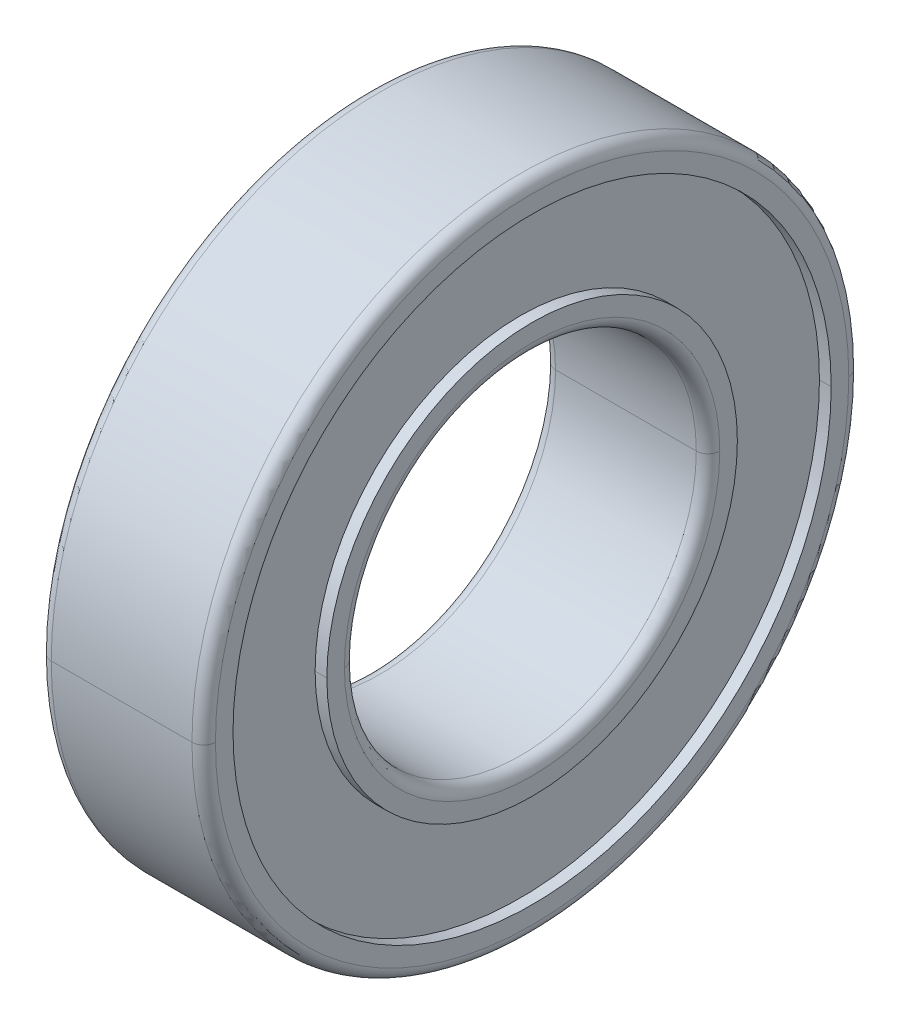
ISO-10303-21;
HEADER;
FILE_DESCRIPTION(('STEP AP214'),'2;1');
FILE_NAME('part.step','',(''),(''),'','','');
FILE_SCHEMA(('AUTOMOTIVE_DESIGN { 1 0 10303 214 1 1 1 1 }'));
ENDSEC;
DATA;
#1=APPLICATION_CONTEXT('core data for automotive mechanical design processes');
#2=APPLICATION_PROTOCOL_DEFINITION('international standard','automotive_design',2000,#1);
#3=PRODUCT_CONTEXT('',#1,'mechanical');
#4=PRODUCT('Part','Part','',(#3));
#5=PRODUCT_RELATED_PRODUCT_CATEGORY('part','',(#4));
#6=PRODUCT_DEFINITION_FORMATION('','',#4);
#7=PRODUCT_DEFINITION_CONTEXT('part definition',#1,'design');
#8=PRODUCT_DEFINITION('design','',#6,#7);
#9=PRODUCT_DEFINITION_SHAPE('','',#8);
#10=(LENGTH_UNIT() NAMED_UNIT(*) SI_UNIT(.MILLI.,.METRE.));
#11=(NAMED_UNIT(*) PLANE_ANGLE_UNIT() SI_UNIT($,.RADIAN.));
#12=(NAMED_UNIT(*) SI_UNIT($,.STERADIAN.) SOLID_ANGLE_UNIT());
#13=UNCERTAINTY_MEASURE_WITH_UNIT(LENGTH_MEASURE(1.E-05),#10,'distance_accuracy_value','');
#14=(GEOMETRIC_REPRESENTATION_CONTEXT(3) GLOBAL_UNCERTAINTY_ASSIGNED_CONTEXT((#13)) GLOBAL_UNIT_ASSIGNED_CONTEXT((#10,
#11,#12)) REPRESENTATION_CONTEXT('',''));
#15=CARTESIAN_POINT('',(0.,0.,0.));
#16=DIRECTION('',(0.,0.,1.));
#17=DIRECTION('',(1.,0.,0.));
#18=AXIS2_PLACEMENT_3D('',#15,#16,#17);
#19=CARTESIAN_POINT('',(0.5,0.,0.));
#20=DIRECTION('',(1.,0.,0.));
#21=DIRECTION('',(0.,0.,-1.));
#22=AXIS2_PLACEMENT_3D('',#19,#20,#21);
#23=TOROIDAL_SURFACE('',#22,13.5,0.5);
#24=CARTESIAN_POINT('',(0.5,0.,13.5));
#25=DIRECTION('',(0.,1.,0.));
#26=DIRECTION('',(0.,0.,1.));
#27=AXIS2_PLACEMENT_3D('',#24,#25,#26);
#28=CIRCLE('',#27,0.5);
#29=CARTESIAN_POINT('',(0.,0.,13.5));
#30=VERTEX_POINT('',#29);
#31=CARTESIAN_POINT('',(0.5,0.,14.));
#32=VERTEX_POINT('',#31);
#33=EDGE_CURVE('E245',#30,#32,#28,.T.);
#34=ORIENTED_EDGE('',*,*,#33,.F.);
#35=CARTESIAN_POINT('',(0.,0.,0.));
#36=DIRECTION('',(-1.,0.,0.));
#37=DIRECTION('',(0.,0.,-1.));
#38=AXIS2_PLACEMENT_3D('',#35,#36,#37);
#39=CIRCLE('',#38,13.5);
#40=CARTESIAN_POINT('',(0.,0.,-13.5));
#41=VERTEX_POINT('',#40);
#42=EDGE_CURVE('E190',#41,#30,#39,.T.);
#43=ORIENTED_EDGE('',*,*,#42,.F.);
#44=CARTESIAN_POINT('',(0.5,0.,-13.5));
#45=DIRECTION('',(0.,-1.,0.));
#46=DIRECTION('',(0.,0.,-1.));
#47=AXIS2_PLACEMENT_3D('',#44,#45,#46);
#48=CIRCLE('',#47,0.5);
#49=CARTESIAN_POINT('',(0.5,0.,-14.));
#50=VERTEX_POINT('',#49);
#51=EDGE_CURVE('E244',#41,#50,#48,.T.);
#52=ORIENTED_EDGE('',*,*,#51,.T.);
#53=CARTESIAN_POINT('',(0.5,0.,0.));
#54=DIRECTION('',(1.,0.,0.));
#55=DIRECTION('',(0.,0.,-1.));
#56=AXIS2_PLACEMENT_3D('',#53,#54,#55);
#57=CIRCLE('',#56,14.);
#58=EDGE_CURVE('E292',#32,#50,#57,.T.);
#59=ORIENTED_EDGE('',*,*,#58,.F.);
#60=EDGE_LOOP('',(#34,#43,#52,#59));
#61=FACE_BOUND('',#60,.T.);
#62=ADVANCED_FACE('F17',(#61),#23,.T.);
#63=CARTESIAN_POINT('',(6.5,0.,0.));
#64=DIRECTION('',(-1.,0.,0.));
#65=DIRECTION('',(0.,0.,1.));
#66=AXIS2_PLACEMENT_3D('',#63,#64,#65);
#67=TOROIDAL_SURFACE('',#66,13.5,0.5);
#68=CARTESIAN_POINT('',(6.5,0.,-13.5));
#69=DIRECTION('',(0.,1.,0.));
#70=DIRECTION('',(0.,0.,1.));
#71=AXIS2_PLACEMENT_3D('',#68,#69,#70);
#72=CIRCLE('',#71,0.5);
#73=CARTESIAN_POINT('',(7.,0.,-13.5));
#74=VERTEX_POINT('',#73);
#75=CARTESIAN_POINT('',(6.5,0.,-14.));
#76=VERTEX_POINT('',#75);
#77=EDGE_CURVE('E298',#74,#76,#72,.T.);
#78=ORIENTED_EDGE('',*,*,#77,.F.);
#79=CARTESIAN_POINT('',(7.,0.,0.));
#80=DIRECTION('',(1.,0.,0.));
#81=DIRECTION('',(0.,0.,1.));
#82=AXIS2_PLACEMENT_3D('',#79,#80,#81);
#83=CIRCLE('',#82,13.5);
#84=CARTESIAN_POINT('',(7.,0.,13.5));
#85=VERTEX_POINT('',#84);
#86=EDGE_CURVE('E223',#85,#74,#83,.T.);
#87=ORIENTED_EDGE('',*,*,#86,.F.);
#88=CARTESIAN_POINT('',(6.5,0.,13.5));
#89=DIRECTION('',(0.,-1.,0.));
#90=DIRECTION('',(0.,0.,-1.));
#91=AXIS2_PLACEMENT_3D('',#88,#89,#90);
#92=CIRCLE('',#91,0.5);
#93=CARTESIAN_POINT('',(6.5,0.,14.));
#94=VERTEX_POINT('',#93);
#95=EDGE_CURVE('E240',#85,#94,#92,.T.);
#96=ORIENTED_EDGE('',*,*,#95,.T.);
#97=CARTESIAN_POINT('',(6.5,0.,0.));
#98=DIRECTION('',(-1.,0.,0.));
#99=DIRECTION('',(0.,0.,1.));
#100=AXIS2_PLACEMENT_3D('',#97,#98,#99);
#101=CIRCLE('',#100,14.);
#102=EDGE_CURVE('E338',#76,#94,#101,.T.);
#103=ORIENTED_EDGE('',*,*,#102,.F.);
#104=EDGE_LOOP('',(#78,#87,#96,#103));
#105=FACE_BOUND('',#104,.T.);
#106=ADVANCED_FACE('F386',(#105),#67,.T.);
#107=CARTESIAN_POINT('',(0.5,0.,0.));
#108=DIRECTION('',(1.,0.,0.));
#109=DIRECTION('',(0.,0.,-1.));
#110=AXIS2_PLACEMENT_3D('',#107,#108,#109);
#111=TOROIDAL_SURFACE('',#110,8.,0.5);
#112=CARTESIAN_POINT('',(0.5,0.,8.));
#113=DIRECTION('',(0.,1.,0.));
#114=DIRECTION('',(0.,0.,1.));
#115=AXIS2_PLACEMENT_3D('',#112,#113,#114);
#116=CIRCLE('',#115,0.5);
#117=CARTESIAN_POINT('',(0.5,0.,7.5));
#118=VERTEX_POINT('',#117);
#119=CARTESIAN_POINT('',(0.,0.,8.));
#120=VERTEX_POINT('',#119);
#121=EDGE_CURVE('E239',#118,#120,#116,.T.);
#122=ORIENTED_EDGE('',*,*,#121,.F.);
#123=CARTESIAN_POINT('',(0.5,0.,0.));
#124=DIRECTION('',(-1.,0.,0.));
#125=DIRECTION('',(0.,0.,-1.));
#126=AXIS2_PLACEMENT_3D('',#123,#124,#125);
#127=CIRCLE('',#126,7.5);
#128=CARTESIAN_POINT('',(0.5,0.,-7.5));
#129=VERTEX_POINT('',#128);
#130=EDGE_CURVE('E283',#129,#118,#127,.T.);
#131=ORIENTED_EDGE('',*,*,#130,.F.);
#132=CARTESIAN_POINT('',(0.5,0.,-8.));
#133=DIRECTION('',(0.,-1.,0.));
#134=DIRECTION('',(0.,0.,-1.));
#135=AXIS2_PLACEMENT_3D('',#132,#133,#134);
#136=CIRCLE('',#135,0.5);
#137=CARTESIAN_POINT('',(0.,0.,-8.));
#138=VERTEX_POINT('',#137);
#139=EDGE_CURVE('E228',#129,#138,#136,.T.);
#140=ORIENTED_EDGE('',*,*,#139,.T.);
#141=CARTESIAN_POINT('',(0.,0.,0.));
#142=DIRECTION('',(1.,0.,0.));
#143=DIRECTION('',(0.,0.,-1.));
#144=AXIS2_PLACEMENT_3D('',#141,#142,#143);
#145=CIRCLE('',#144,8.);
#146=EDGE_CURVE('E261',#120,#138,#145,.T.);
#147=ORIENTED_EDGE('',*,*,#146,.F.);
#148=EDGE_LOOP('',(#122,#131,#140,#147));
#149=FACE_BOUND('',#148,.T.);
#150=ADVANCED_FACE('F408',(#149),#111,.T.);
#151=CARTESIAN_POINT('',(6.5,0.,0.));
#152=DIRECTION('',(-1.,0.,0.));
#153=DIRECTION('',(0.,0.,1.));
#154=AXIS2_PLACEMENT_3D('',#151,#152,#153);
#155=TOROIDAL_SURFACE('',#154,8.,0.5);
#156=CARTESIAN_POINT('',(6.5,0.,-8.));
#157=DIRECTION('',(0.,1.,0.));
#158=DIRECTION('',(0.,0.,1.));
#159=AXIS2_PLACEMENT_3D('',#156,#157,#158);
#160=CIRCLE('',#159,0.5);
#161=CARTESIAN_POINT('',(6.5,0.,-7.5));
#162=VERTEX_POINT('',#161);
#163=CARTESIAN_POINT('',(7.,0.,-8.));
#164=VERTEX_POINT('',#163);
#165=EDGE_CURVE('E227',#162,#164,#160,.T.);
#166=ORIENTED_EDGE('',*,*,#165,.F.);
#167=CARTESIAN_POINT('',(6.5,0.,0.));
#168=DIRECTION('',(1.,0.,0.));
#169=DIRECTION('',(0.,0.,1.));
#170=AXIS2_PLACEMENT_3D('',#167,#168,#169);
#171=CIRCLE('',#170,7.5);
#172=CARTESIAN_POINT('',(6.5,0.,7.5));
#173=VERTEX_POINT('',#172);
#174=EDGE_CURVE('E211',#173,#162,#171,.T.);
#175=ORIENTED_EDGE('',*,*,#174,.F.);
#176=CARTESIAN_POINT('',(6.5,0.,8.));
#177=DIRECTION('',(0.,-1.,0.));
#178=DIRECTION('',(0.,0.,-1.));
#179=AXIS2_PLACEMENT_3D('',#176,#177,#178);
#180=CIRCLE('',#179,0.5);
#181=CARTESIAN_POINT('',(7.,0.,8.));
#182=VERTEX_POINT('',#181);
#183=EDGE_CURVE('E277',#173,#182,#180,.T.);
#184=ORIENTED_EDGE('',*,*,#183,.T.);
#185=CARTESIAN_POINT('',(7.,0.,0.));
#186=DIRECTION('',(-1.,0.,0.));
#187=DIRECTION('',(0.,0.,1.));
#188=AXIS2_PLACEMENT_3D('',#185,#186,#187);
#189=CIRCLE('',#188,8.);
#190=EDGE_CURVE('E232',#164,#182,#189,.T.);
#191=ORIENTED_EDGE('',*,*,#190,.F.);
#192=EDGE_LOOP('',(#166,#175,#184,#191));
#193=FACE_BOUND('',#192,.T.);
#194=ADVANCED_FACE('F482',(#193),#155,.T.);
#195=CARTESIAN_POINT('',(0.,0.,0.));
#196=DIRECTION('',(-1.,0.,0.));
#197=DIRECTION('',(0.,0.,1.));
#198=AXIS2_PLACEMENT_3D('',#195,#196,#197);
#199=CYLINDRICAL_SURFACE('',#198,8.75);
#200=DIRECTION('',(-1.,0.,0.));
#201=VECTOR('',#200,1.);
#202=CARTESIAN_POINT('',(0.,0.,-8.75));
#203=LINE('',#202,#201);
#204=CARTESIAN_POINT('',(0.5,0.,-8.75));
#205=VERTEX_POINT('',#204);
#206=CARTESIAN_POINT('',(0.,0.,-8.75));
#207=VERTEX_POINT('',#206);
#208=EDGE_CURVE('E321',#205,#207,#203,.T.);
#209=ORIENTED_EDGE('',*,*,#208,.F.);
#210=CARTESIAN_POINT('',(0.5,0.,0.));
#211=DIRECTION('',(-1.,0.,0.));
#212=DIRECTION('',(0.,0.,1.));
#213=AXIS2_PLACEMENT_3D('',#210,#211,#212);
#214=CIRCLE('',#213,8.75);
#215=CARTESIAN_POINT('',(0.5,0.,8.75));
#216=VERTEX_POINT('',#215);
#217=EDGE_CURVE('E11',#205,#216,#214,.T.);
#218=ORIENTED_EDGE('',*,*,#217,.T.);
#219=DIRECTION('',(-1.,0.,0.));
#220=VECTOR('',#219,1.);
#221=CARTESIAN_POINT('',(0.,0.,8.75));
#222=LINE('',#221,#220);
#223=CARTESIAN_POINT('',(0.,0.,8.75));
#224=VERTEX_POINT('',#223);
#225=EDGE_CURVE('E207',#216,#224,#222,.T.);
#226=ORIENTED_EDGE('',*,*,#225,.T.);
#227=CARTESIAN_POINT('',(0.,0.,0.));
#228=DIRECTION('',(-1.,0.,0.));
#229=DIRECTION('',(0.,0.,1.));
#230=AXIS2_PLACEMENT_3D('',#227,#228,#229);
#231=CIRCLE('',#230,8.75);
#232=EDGE_CURVE('E333',#207,#224,#231,.T.);
#233=ORIENTED_EDGE('',*,*,#232,.F.);
#234=EDGE_LOOP('',(#209,#218,#226,#233));
#235=FACE_BOUND('',#234,.T.);
#236=ADVANCED_FACE('F412',(#235),#199,.T.);
#237=CARTESIAN_POINT('',(0.5,12.75,0.));
#238=DIRECTION('',(1.,0.,0.));
#239=DIRECTION('',(0.,1.,0.));
#240=AXIS2_PLACEMENT_3D('',#237,#238,#239);
#241=PLANE('',#240);
#242=CARTESIAN_POINT('',(0.5,0.,0.));
#243=DIRECTION('',(-1.,0.,0.));
#244=DIRECTION('',(0.,0.,1.));
#245=AXIS2_PLACEMENT_3D('',#242,#243,#244);
#246=CIRCLE('',#245,8.75);
#247=EDGE_CURVE('E280',#216,#205,#246,.T.);
#248=ORIENTED_EDGE('',*,*,#247,.F.);
#249=ORIENTED_EDGE('',*,*,#217,.F.);
#250=EDGE_LOOP('',(#248,#249));
#251=FACE_BOUND('',#250,.T.);
#252=CARTESIAN_POINT('',(0.5,0.,0.));
#253=DIRECTION('',(-1.,0.,0.));
#254=DIRECTION('',(0.,0.,1.));
#255=AXIS2_PLACEMENT_3D('',#252,#253,#254);
#256=CIRCLE('',#255,12.75);
#257=CARTESIAN_POINT('',(0.5,0.,12.75));
#258=VERTEX_POINT('',#257);
#259=CARTESIAN_POINT('',(0.5,0.,-12.75));
#260=VERTEX_POINT('',#259);
#261=EDGE_CURVE('E21',#258,#260,#256,.T.);
#262=ORIENTED_EDGE('',*,*,#261,.T.);
#263=CARTESIAN_POINT('',(0.5,0.,0.));
#264=DIRECTION('',(-1.,0.,0.));
#265=DIRECTION('',(0.,0.,1.));
#266=AXIS2_PLACEMENT_3D('',#263,#264,#265);
#267=CIRCLE('',#266,12.75);
#268=EDGE_CURVE('E200',#260,#258,#267,.T.);
#269=ORIENTED_EDGE('',*,*,#268,.T.);
#270=EDGE_LOOP('',(#262,#269));
#271=FACE_BOUND('',#270,.T.);
#272=ADVANCED_FACE('F425',(#251,#271),#241,.F.);
#273=CARTESIAN_POINT('',(0.,0.,0.));
#274=DIRECTION('',(-1.,0.,0.));
#275=DIRECTION('',(0.,0.,1.));
#276=AXIS2_PLACEMENT_3D('',#273,#274,#275);
#277=CYLINDRICAL_SURFACE('',#276,12.75);
#278=DIRECTION('',(-1.,0.,0.));
#279=VECTOR('',#278,1.);
#280=CARTESIAN_POINT('',(0.,0.,-12.75));
#281=LINE('',#280,#279);
#282=CARTESIAN_POINT('',(0.,0.,-12.75));
#283=VERTEX_POINT('',#282);
#284=EDGE_CURVE('E183',#260,#283,#281,.T.);
#285=ORIENTED_EDGE('',*,*,#284,.F.);
#286=ORIENTED_EDGE('',*,*,#261,.F.);
#287=DIRECTION('',(-1.,0.,0.));
#288=VECTOR('',#287,1.);
#289=CARTESIAN_POINT('',(0.,0.,12.75));
#290=LINE('',#289,#288);
#291=CARTESIAN_POINT('',(0.,0.,12.75));
#292=VERTEX_POINT('',#291);
#293=EDGE_CURVE('E186',#258,#292,#290,.T.);
#294=ORIENTED_EDGE('',*,*,#293,.T.);
#295=CARTESIAN_POINT('',(0.,0.,0.));
#296=DIRECTION('',(-1.,0.,0.));
#297=DIRECTION('',(0.,0.,1.));
#298=AXIS2_PLACEMENT_3D('',#295,#296,#297);
#299=CIRCLE('',#298,12.75);
#300=EDGE_CURVE('E180',#292,#283,#299,.T.);
#301=ORIENTED_EDGE('',*,*,#300,.T.);
#302=EDGE_LOOP('',(#285,#286,#294,#301));
#303=FACE_BOUND('',#302,.T.);
#304=ADVANCED_FACE('F19',(#303),#277,.F.);
#305=CARTESIAN_POINT('',(0.,14.,0.));
#306=DIRECTION('',(1.,0.,0.));
#307=DIRECTION('',(0.,1.,0.));
#308=AXIS2_PLACEMENT_3D('',#305,#306,#307);
#309=PLANE('',#308);
#310=ORIENTED_EDGE('',*,*,#300,.F.);
#311=CARTESIAN_POINT('',(0.,0.,0.));
#312=DIRECTION('',(-1.,0.,0.));
#313=DIRECTION('',(0.,0.,1.));
#314=AXIS2_PLACEMENT_3D('',#311,#312,#313);
#315=CIRCLE('',#314,12.75);
#316=EDGE_CURVE('E192',#283,#292,#315,.T.);
#317=ORIENTED_EDGE('',*,*,#316,.F.);
#318=EDGE_LOOP('',(#310,#317));
#319=FACE_BOUND('',#318,.T.);
#320=ORIENTED_EDGE('',*,*,#42,.T.);
#321=CARTESIAN_POINT('',(0.,0.,0.));
#322=DIRECTION('',(-1.,0.,0.));
#323=DIRECTION('',(0.,0.,-1.));
#324=AXIS2_PLACEMENT_3D('',#321,#322,#323);
#325=CIRCLE('',#324,13.5);
#326=EDGE_CURVE('E326',#30,#41,#325,.T.);
#327=ORIENTED_EDGE('',*,*,#326,.T.);
#328=EDGE_LOOP('',(#320,#327));
#329=FACE_BOUND('',#328,.T.);
#330=ADVANCED_FACE('F193',(#319,#329),#309,.F.);
#331=CARTESIAN_POINT('',(0.,0.,0.));
#332=DIRECTION('',(-1.,0.,0.));
#333=DIRECTION('',(0.,0.,1.));
#334=AXIS2_PLACEMENT_3D('',#331,#332,#333);
#335=CYLINDRICAL_SURFACE('',#334,14.);
#336=DIRECTION('',(-1.,0.,0.));
#337=VECTOR('',#336,1.);
#338=CARTESIAN_POINT('',(0.,0.,-14.));
#339=LINE('',#338,#337);
#340=EDGE_CURVE('E231',#76,#50,#339,.T.);
#341=ORIENTED_EDGE('',*,*,#340,.F.);
#342=ORIENTED_EDGE('',*,*,#102,.T.);
#343=DIRECTION('',(-1.,0.,0.));
#344=VECTOR('',#343,1.);
#345=CARTESIAN_POINT('',(0.,0.,14.));
#346=LINE('',#345,#344);
#347=EDGE_CURVE('E301',#94,#32,#346,.T.);
#348=ORIENTED_EDGE('',*,*,#347,.T.);
#349=ORIENTED_EDGE('',*,*,#58,.T.);
#350=EDGE_LOOP('',(#341,#342,#348,#349));
#351=FACE_BOUND('',#350,.T.);
#352=ADVANCED_FACE('F379',(#351),#335,.T.);
#353=CARTESIAN_POINT('',(7.,12.75,0.));
#354=DIRECTION('',(-1.,0.,0.));
#355=DIRECTION('',(0.,0.,1.));
#356=AXIS2_PLACEMENT_3D('',#353,#354,#355);
#357=PLANE('',#356);
#358=CARTESIAN_POINT('',(7.,0.,0.));
#359=DIRECTION('',(-1.,0.,0.));
#360=DIRECTION('',(0.,0.,1.));
#361=AXIS2_PLACEMENT_3D('',#358,#359,#360);
#362=CIRCLE('',#361,12.75);
#363=CARTESIAN_POINT('',(7.,0.,12.75));
#364=VERTEX_POINT('',#363);
#365=CARTESIAN_POINT('',(7.,0.,-12.75));
#366=VERTEX_POINT('',#365);
#367=EDGE_CURVE('E99',#364,#366,#362,.T.);
#368=ORIENTED_EDGE('',*,*,#367,.T.);
#369=CARTESIAN_POINT('',(7.,0.,0.));
#370=DIRECTION('',(-1.,0.,0.));
#371=DIRECTION('',(0.,0.,1.));
#372=AXIS2_PLACEMENT_3D('',#369,#370,#371);
#373=CIRCLE('',#372,12.75);
#374=EDGE_CURVE('E310',#366,#364,#373,.T.);
#375=ORIENTED_EDGE('',*,*,#374,.T.);
#376=EDGE_LOOP('',(#368,#375));
#377=FACE_BOUND('',#376,.T.);
#378=ORIENTED_EDGE('',*,*,#86,.T.);
#379=CARTESIAN_POINT('',(7.,0.,0.));
#380=DIRECTION('',(1.,0.,0.));
#381=DIRECTION('',(0.,0.,1.));
#382=AXIS2_PLACEMENT_3D('',#379,#380,#381);
#383=CIRCLE('',#382,13.5);
#384=EDGE_CURVE('E295',#74,#85,#383,.T.);
#385=ORIENTED_EDGE('',*,*,#384,.T.);
#386=EDGE_LOOP('',(#378,#385));
#387=FACE_BOUND('',#386,.T.);
#388=ADVANCED_FACE('F418',(#377,#387),#357,.F.);
#389=CARTESIAN_POINT('',(0.,0.,0.));
#390=DIRECTION('',(-1.,0.,0.));
#391=DIRECTION('',(0.,0.,1.));
#392=AXIS2_PLACEMENT_3D('',#389,#390,#391);
#393=CYLINDRICAL_SURFACE('',#392,12.75);
#394=DIRECTION('',(-1.,0.,0.));
#395=VECTOR('',#394,1.);
#396=CARTESIAN_POINT('',(0.,0.,-12.75));
#397=LINE('',#396,#395);
#398=CARTESIAN_POINT('',(6.5,0.,-12.75));
#399=VERTEX_POINT('',#398);
#400=EDGE_CURVE('E267',#366,#399,#397,.T.);
#401=ORIENTED_EDGE('',*,*,#400,.F.);
#402=ORIENTED_EDGE('',*,*,#367,.F.);
#403=DIRECTION('',(-1.,0.,0.));
#404=VECTOR('',#403,1.);
#405=CARTESIAN_POINT('',(0.,0.,12.75));
#406=LINE('',#405,#404);
#407=CARTESIAN_POINT('',(6.5,0.,12.75));
#408=VERTEX_POINT('',#407);
#409=EDGE_CURVE('E266',#364,#408,#406,.T.);
#410=ORIENTED_EDGE('',*,*,#409,.T.);
#411=CARTESIAN_POINT('',(6.5,0.,0.));
#412=DIRECTION('',(-1.,0.,0.));
#413=DIRECTION('',(0.,0.,1.));
#414=AXIS2_PLACEMENT_3D('',#411,#412,#413);
#415=CIRCLE('',#414,12.75);
#416=EDGE_CURVE('E89',#408,#399,#415,.T.);
#417=ORIENTED_EDGE('',*,*,#416,.T.);
#418=EDGE_LOOP('',(#401,#402,#410,#417));
#419=FACE_BOUND('',#418,.T.);
#420=ADVANCED_FACE('F414',(#419),#393,.F.);
#421=CARTESIAN_POINT('',(6.5,8.75,0.));
#422=DIRECTION('',(-1.,0.,0.));
#423=DIRECTION('',(0.,0.,1.));
#424=AXIS2_PLACEMENT_3D('',#421,#422,#423);
#425=PLANE('',#424);
#426=CARTESIAN_POINT('',(6.5,0.,0.));
#427=DIRECTION('',(-1.,0.,0.));
#428=DIRECTION('',(0.,0.,1.));
#429=AXIS2_PLACEMENT_3D('',#426,#427,#428);
#430=CIRCLE('',#429,8.75);
#431=CARTESIAN_POINT('',(6.5,0.,8.75));
#432=VERTEX_POINT('',#431);
#433=CARTESIAN_POINT('',(6.5,0.,-8.75));
#434=VERTEX_POINT('',#433);
#435=EDGE_CURVE('E219',#432,#434,#430,.T.);
#436=ORIENTED_EDGE('',*,*,#435,.T.);
#437=CARTESIAN_POINT('',(6.5,0.,0.));
#438=DIRECTION('',(-1.,0.,0.));
#439=DIRECTION('',(0.,0.,1.));
#440=AXIS2_PLACEMENT_3D('',#437,#438,#439);
#441=CIRCLE('',#440,8.75);
#442=EDGE_CURVE('E41',#434,#432,#441,.T.);
#443=ORIENTED_EDGE('',*,*,#442,.T.);
#444=EDGE_LOOP('',(#436,#443));
#445=FACE_BOUND('',#444,.T.);
#446=ORIENTED_EDGE('',*,*,#416,.F.);
#447=CARTESIAN_POINT('',(6.5,0.,0.));
#448=DIRECTION('',(-1.,0.,0.));
#449=DIRECTION('',(0.,0.,1.));
#450=AXIS2_PLACEMENT_3D('',#447,#448,#449);
#451=CIRCLE('',#450,12.75);
#452=EDGE_CURVE('E262',#399,#408,#451,.T.);
#453=ORIENTED_EDGE('',*,*,#452,.F.);
#454=EDGE_LOOP('',(#446,#453));
#455=FACE_BOUND('',#454,.T.);
#456=ADVANCED_FACE('F417',(#445,#455),#425,.F.);
#457=CARTESIAN_POINT('',(0.,0.,0.));
#458=DIRECTION('',(-1.,0.,0.));
#459=DIRECTION('',(0.,0.,1.));
#460=AXIS2_PLACEMENT_3D('',#457,#458,#459);
#461=CYLINDRICAL_SURFACE('',#460,8.75);
#462=DIRECTION('',(-1.,0.,0.));
#463=VECTOR('',#462,1.);
#464=CARTESIAN_POINT('',(0.,0.,-8.75));
#465=LINE('',#464,#463);
#466=CARTESIAN_POINT('',(7.,0.,-8.75));
#467=VERTEX_POINT('',#466);
#468=EDGE_CURVE('E215',#467,#434,#465,.T.);
#469=ORIENTED_EDGE('',*,*,#468,.F.);
#470=CARTESIAN_POINT('',(7.,0.,0.));
#471=DIRECTION('',(-1.,0.,0.));
#472=DIRECTION('',(0.,0.,1.));
#473=AXIS2_PLACEMENT_3D('',#470,#471,#472);
#474=CIRCLE('',#473,8.75);
#475=CARTESIAN_POINT('',(7.,0.,8.75));
#476=VERTEX_POINT('',#475);
#477=EDGE_CURVE('E235',#467,#476,#474,.T.);
#478=ORIENTED_EDGE('',*,*,#477,.T.);
#479=DIRECTION('',(-1.,0.,0.));
#480=VECTOR('',#479,1.);
#481=CARTESIAN_POINT('',(0.,0.,8.75));
#482=LINE('',#481,#480);
#483=EDGE_CURVE('E214',#476,#432,#482,.T.);
#484=ORIENTED_EDGE('',*,*,#483,.T.);
#485=ORIENTED_EDGE('',*,*,#442,.F.);
#486=EDGE_LOOP('',(#469,#478,#484,#485));
#487=FACE_BOUND('',#486,.T.);
#488=ADVANCED_FACE('F419',(#487),#461,.T.);
#489=CARTESIAN_POINT('',(7.,7.5,0.));
#490=DIRECTION('',(-1.,0.,0.));
#491=DIRECTION('',(0.,0.,1.));
#492=AXIS2_PLACEMENT_3D('',#489,#490,#491);
#493=PLANE('',#492);
#494=CARTESIAN_POINT('',(7.,0.,0.));
#495=DIRECTION('',(-1.,0.,0.));
#496=DIRECTION('',(0.,0.,1.));
#497=AXIS2_PLACEMENT_3D('',#494,#495,#496);
#498=CIRCLE('',#497,8.);
#499=EDGE_CURVE('E281',#182,#164,#498,.T.);
#500=ORIENTED_EDGE('',*,*,#499,.T.);
#501=ORIENTED_EDGE('',*,*,#190,.T.);
#502=EDGE_LOOP('',(#500,#501));
#503=FACE_BOUND('',#502,.T.);
#504=CARTESIAN_POINT('',(7.,0.,0.));
#505=DIRECTION('',(-1.,0.,0.));
#506=DIRECTION('',(0.,0.,1.));
#507=AXIS2_PLACEMENT_3D('',#504,#505,#506);
#508=CIRCLE('',#507,8.75);
#509=EDGE_CURVE('E220',#476,#467,#508,.T.);
#510=ORIENTED_EDGE('',*,*,#509,.F.);
#511=ORIENTED_EDGE('',*,*,#477,.F.);
#512=EDGE_LOOP('',(#510,#511));
#513=FACE_BOUND('',#512,.T.);
#514=ADVANCED_FACE('F422',(#503,#513),#493,.F.);
#515=CARTESIAN_POINT('',(0.,0.,0.));
#516=DIRECTION('',(-1.,0.,0.));
#517=DIRECTION('',(0.,0.,1.));
#518=AXIS2_PLACEMENT_3D('',#515,#516,#517);
#519=CYLINDRICAL_SURFACE('',#518,7.5);
#520=DIRECTION('',(-1.,0.,0.));
#521=VECTOR('',#520,1.);
#522=CARTESIAN_POINT('',(0.,0.,-7.5));
#523=LINE('',#522,#521);
#524=EDGE_CURVE('E142',#162,#129,#523,.T.);
#525=ORIENTED_EDGE('',*,*,#524,.F.);
#526=CARTESIAN_POINT('',(6.5,0.,0.));
#527=DIRECTION('',(1.,0.,0.));
#528=DIRECTION('',(0.,0.,1.));
#529=AXIS2_PLACEMENT_3D('',#526,#527,#528);
#530=CIRCLE('',#529,7.5);
#531=EDGE_CURVE('E224',#162,#173,#530,.T.);
#532=ORIENTED_EDGE('',*,*,#531,.T.);
#533=DIRECTION('',(-1.,0.,0.));
#534=VECTOR('',#533,1.);
#535=CARTESIAN_POINT('',(0.,0.,7.5));
#536=LINE('',#535,#534);
#537=EDGE_CURVE('E129',#173,#118,#536,.T.);
#538=ORIENTED_EDGE('',*,*,#537,.T.);
#539=CARTESIAN_POINT('',(0.5,0.,0.));
#540=DIRECTION('',(-1.,0.,0.));
#541=DIRECTION('',(0.,0.,-1.));
#542=AXIS2_PLACEMENT_3D('',#539,#540,#541);
#543=CIRCLE('',#542,7.5);
#544=EDGE_CURVE('E236',#118,#129,#543,.T.);
#545=ORIENTED_EDGE('',*,*,#544,.T.);
#546=EDGE_LOOP('',(#525,#532,#538,#545));
#547=FACE_BOUND('',#546,.T.);
#548=ADVANCED_FACE('F430',(#547),#519,.F.);
#549=CARTESIAN_POINT('',(0.,8.75,0.));
#550=DIRECTION('',(1.,0.,0.));
#551=DIRECTION('',(0.,1.,0.));
#552=AXIS2_PLACEMENT_3D('',#549,#550,#551);
#553=PLANE('',#552);
#554=CARTESIAN_POINT('',(0.,0.,0.));
#555=DIRECTION('',(1.,0.,0.));
#556=DIRECTION('',(0.,0.,-1.));
#557=AXIS2_PLACEMENT_3D('',#554,#555,#556);
#558=CIRCLE('',#557,8.);
#559=EDGE_CURVE('E330',#138,#120,#558,.T.);
#560=ORIENTED_EDGE('',*,*,#559,.T.);
#561=ORIENTED_EDGE('',*,*,#146,.T.);
#562=EDGE_LOOP('',(#560,#561));
#563=FACE_BOUND('',#562,.T.);
#564=CARTESIAN_POINT('',(0.,0.,0.));
#565=DIRECTION('',(-1.,0.,0.));
#566=DIRECTION('',(0.,0.,1.));
#567=AXIS2_PLACEMENT_3D('',#564,#565,#566);
#568=CIRCLE('',#567,8.75);
#569=EDGE_CURVE('E276',#224,#207,#568,.T.);
#570=ORIENTED_EDGE('',*,*,#569,.T.);
#571=ORIENTED_EDGE('',*,*,#232,.T.);
#572=EDGE_LOOP('',(#570,#571));
#573=FACE_BOUND('',#572,.T.);
#574=ADVANCED_FACE('F502',(#563,#573),#553,.F.);
#575=CARTESIAN_POINT('',(0.,0.,0.));
#576=DIRECTION('',(-1.,0.,0.));
#577=DIRECTION('',(0.,0.,1.));
#578=AXIS2_PLACEMENT_3D('',#575,#576,#577);
#579=CYLINDRICAL_SURFACE('',#578,7.5);
#580=ORIENTED_EDGE('',*,*,#174,.T.);
#581=ORIENTED_EDGE('',*,*,#524,.T.);
#582=ORIENTED_EDGE('',*,*,#130,.T.);
#583=ORIENTED_EDGE('',*,*,#537,.F.);
#584=EDGE_LOOP('',(#580,#581,#582,#583));
#585=FACE_BOUND('',#584,.T.);
#586=ADVANCED_FACE('F437',(#585),#579,.F.);
#587=CARTESIAN_POINT('',(0.,0.,0.));
#588=DIRECTION('',(-1.,0.,0.));
#589=DIRECTION('',(0.,0.,1.));
#590=AXIS2_PLACEMENT_3D('',#587,#588,#589);
#591=CYLINDRICAL_SURFACE('',#590,8.75);
#592=ORIENTED_EDGE('',*,*,#509,.T.);
#593=ORIENTED_EDGE('',*,*,#468,.T.);
#594=ORIENTED_EDGE('',*,*,#435,.F.);
#595=ORIENTED_EDGE('',*,*,#483,.F.);
#596=EDGE_LOOP('',(#592,#593,#594,#595));
#597=FACE_BOUND('',#596,.T.);
#598=ADVANCED_FACE('F433',(#597),#591,.T.);
#599=CARTESIAN_POINT('',(0.,0.,0.));
#600=DIRECTION('',(-1.,0.,0.));
#601=DIRECTION('',(0.,0.,1.));
#602=AXIS2_PLACEMENT_3D('',#599,#600,#601);
#603=CYLINDRICAL_SURFACE('',#602,12.75);
#604=ORIENTED_EDGE('',*,*,#374,.F.);
#605=ORIENTED_EDGE('',*,*,#400,.T.);
#606=ORIENTED_EDGE('',*,*,#452,.T.);
#607=ORIENTED_EDGE('',*,*,#409,.F.);
#608=EDGE_LOOP('',(#604,#605,#606,#607));
#609=FACE_BOUND('',#608,.T.);
#610=ADVANCED_FACE('F436',(#609),#603,.F.);
#611=CARTESIAN_POINT('',(0.,0.,0.));
#612=DIRECTION('',(-1.,0.,0.));
#613=DIRECTION('',(0.,0.,1.));
#614=AXIS2_PLACEMENT_3D('',#611,#612,#613);
#615=CYLINDRICAL_SURFACE('',#614,14.);
#616=CARTESIAN_POINT('',(6.5,0.,0.));
#617=DIRECTION('',(-1.,0.,0.));
#618=DIRECTION('',(0.,0.,1.));
#619=AXIS2_PLACEMENT_3D('',#616,#617,#618);
#620=CIRCLE('',#619,14.);
#621=EDGE_CURVE('E289',#94,#76,#620,.T.);
#622=ORIENTED_EDGE('',*,*,#621,.T.);
#623=ORIENTED_EDGE('',*,*,#340,.T.);
#624=CARTESIAN_POINT('',(0.5,0.,0.));
#625=DIRECTION('',(1.,0.,0.));
#626=DIRECTION('',(0.,0.,-1.));
#627=AXIS2_PLACEMENT_3D('',#624,#625,#626);
#628=CIRCLE('',#627,14.);
#629=EDGE_CURVE('E241',#50,#32,#628,.T.);
#630=ORIENTED_EDGE('',*,*,#629,.T.);
#631=ORIENTED_EDGE('',*,*,#347,.F.);
#632=EDGE_LOOP('',(#622,#623,#630,#631));
#633=FACE_BOUND('',#632,.T.);
#634=ADVANCED_FACE('F383',(#633),#615,.T.);
#635=CARTESIAN_POINT('',(0.,0.,0.));
#636=DIRECTION('',(-1.,0.,0.));
#637=DIRECTION('',(0.,0.,1.));
#638=AXIS2_PLACEMENT_3D('',#635,#636,#637);
#639=CYLINDRICAL_SURFACE('',#638,12.75);
#640=ORIENTED_EDGE('',*,*,#268,.F.);
#641=ORIENTED_EDGE('',*,*,#284,.T.);
#642=ORIENTED_EDGE('',*,*,#316,.T.);
#643=ORIENTED_EDGE('',*,*,#293,.F.);
#644=EDGE_LOOP('',(#640,#641,#642,#643));
#645=FACE_BOUND('',#644,.T.);
#646=ADVANCED_FACE('F198',(#645),#639,.F.);
#647=CARTESIAN_POINT('',(0.,0.,0.));
#648=DIRECTION('',(-1.,0.,0.));
#649=DIRECTION('',(0.,0.,1.));
#650=AXIS2_PLACEMENT_3D('',#647,#648,#649);
#651=CYLINDRICAL_SURFACE('',#650,8.75);
#652=ORIENTED_EDGE('',*,*,#247,.T.);
#653=ORIENTED_EDGE('',*,*,#208,.T.);
#654=ORIENTED_EDGE('',*,*,#569,.F.);
#655=ORIENTED_EDGE('',*,*,#225,.F.);
#656=EDGE_LOOP('',(#652,#653,#654,#655));
#657=FACE_BOUND('',#656,.T.);
#658=ADVANCED_FACE('F440',(#657),#651,.T.);
#659=CARTESIAN_POINT('',(6.5,0.,0.));
#660=DIRECTION('',(-1.,0.,0.));
#661=DIRECTION('',(0.,0.,1.));
#662=AXIS2_PLACEMENT_3D('',#659,#660,#661);
#663=TOROIDAL_SURFACE('',#662,8.,0.5);
#664=ORIENTED_EDGE('',*,*,#531,.F.);
#665=ORIENTED_EDGE('',*,*,#165,.T.);
#666=ORIENTED_EDGE('',*,*,#499,.F.);
#667=ORIENTED_EDGE('',*,*,#183,.F.);
#668=EDGE_LOOP('',(#664,#665,#666,#667));
#669=FACE_BOUND('',#668,.T.);
#670=ADVANCED_FACE('F398',(#669),#663,.T.);
#671=CARTESIAN_POINT('',(0.5,0.,0.));
#672=DIRECTION('',(1.,0.,0.));
#673=DIRECTION('',(0.,0.,-1.));
#674=AXIS2_PLACEMENT_3D('',#671,#672,#673);
#675=TOROIDAL_SURFACE('',#674,8.,0.5);
#676=ORIENTED_EDGE('',*,*,#544,.F.);
#677=ORIENTED_EDGE('',*,*,#121,.T.);
#678=ORIENTED_EDGE('',*,*,#559,.F.);
#679=ORIENTED_EDGE('',*,*,#139,.F.);
#680=EDGE_LOOP('',(#676,#677,#678,#679));
#681=FACE_BOUND('',#680,.T.);
#682=ADVANCED_FACE('F389',(#681),#675,.T.);
#683=CARTESIAN_POINT('',(6.5,0.,0.));
#684=DIRECTION('',(-1.,0.,0.));
#685=DIRECTION('',(0.,0.,1.));
#686=AXIS2_PLACEMENT_3D('',#683,#684,#685);
#687=TOROIDAL_SURFACE('',#686,13.5,0.5);
#688=ORIENTED_EDGE('',*,*,#384,.F.);
#689=ORIENTED_EDGE('',*,*,#77,.T.);
#690=ORIENTED_EDGE('',*,*,#621,.F.);
#691=ORIENTED_EDGE('',*,*,#95,.F.);
#692=EDGE_LOOP('',(#688,#689,#690,#691));
#693=FACE_BOUND('',#692,.T.);
#694=ADVANCED_FACE('F387',(#693),#687,.T.);
#695=CARTESIAN_POINT('',(0.5,0.,0.));
#696=DIRECTION('',(1.,0.,0.));
#697=DIRECTION('',(0.,0.,-1.));
#698=AXIS2_PLACEMENT_3D('',#695,#696,#697);
#699=TOROIDAL_SURFACE('',#698,13.5,0.5);
#700=ORIENTED_EDGE('',*,*,#326,.F.);
#701=ORIENTED_EDGE('',*,*,#33,.T.);
#702=ORIENTED_EDGE('',*,*,#629,.F.);
#703=ORIENTED_EDGE('',*,*,#51,.F.);
#704=EDGE_LOOP('',(#700,#701,#702,#703));
#705=FACE_BOUND('',#704,.T.);
#706=ADVANCED_FACE('F376',(#705),#699,.T.);
#707=CLOSED_SHELL('',(#62,#106,#150,#194,#236,#272,#304,#330,#352,#388,#420,#456,#488,#514,#548,
#574,#586,#598,#610,#634,#646,#658,#670,#682,#694,#706));
#708=MANIFOLD_SOLID_BREP('B1',#707);
#709=ADVANCED_BREP_SHAPE_REPRESENTATION('',(#18,#708),#14);
#710=SHAPE_DEFINITION_REPRESENTATION(#9,#709);
ENDSEC;
END-ISO-10303-21;
